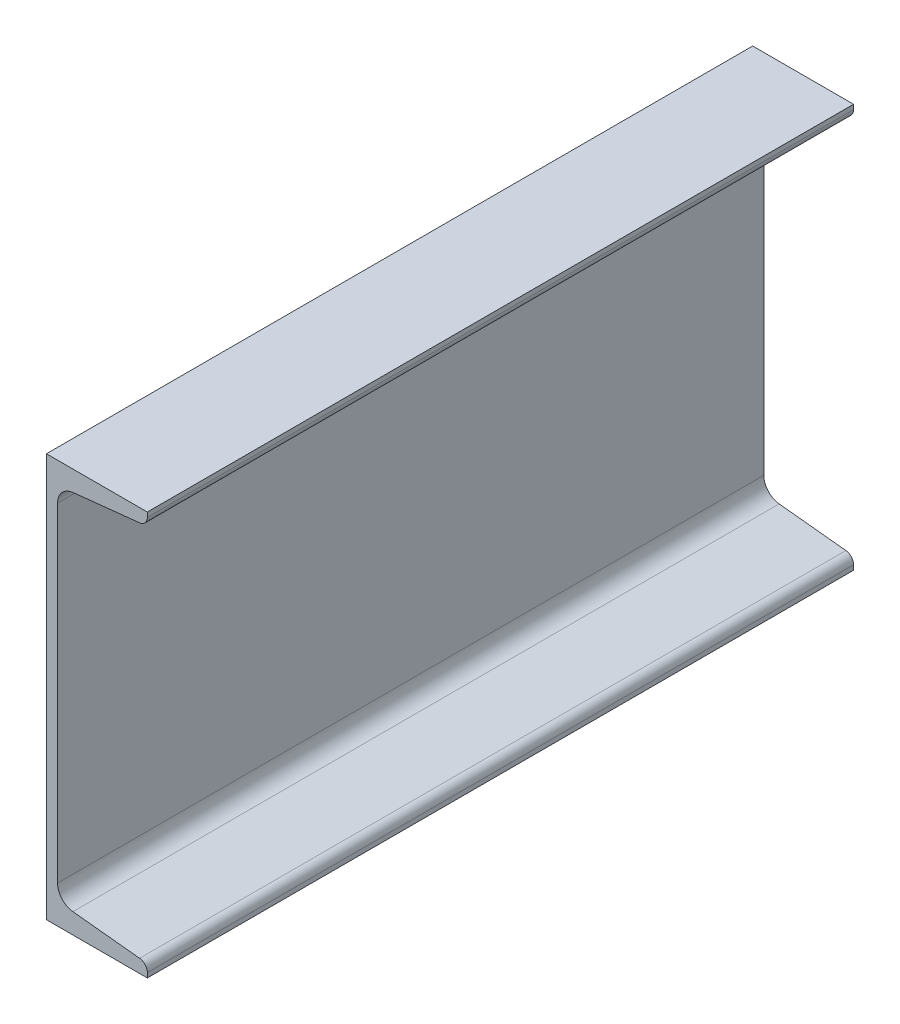
ISO-10303-21;
HEADER;
FILE_DESCRIPTION(('STEP AP214'),'2;1');
FILE_NAME('part.step','',(''),(''),'','','');
FILE_SCHEMA(('AUTOMOTIVE_DESIGN { 1 0 10303 214 1 1 1 1 }'));
ENDSEC;
DATA;
#1=APPLICATION_CONTEXT('core data for automotive mechanical design processes');
#2=APPLICATION_PROTOCOL_DEFINITION('international standard','automotive_design',2000,#1);
#3=PRODUCT_CONTEXT('',#1,'mechanical');
#4=PRODUCT('Part','Part','',(#3));
#5=PRODUCT_RELATED_PRODUCT_CATEGORY('part','',(#4));
#6=PRODUCT_DEFINITION_FORMATION('','',#4);
#7=PRODUCT_DEFINITION_CONTEXT('part definition',#1,'design');
#8=PRODUCT_DEFINITION('design','',#6,#7);
#9=PRODUCT_DEFINITION_SHAPE('','',#8);
#10=(LENGTH_UNIT() NAMED_UNIT(*) SI_UNIT(.MILLI.,.METRE.));
#11=(NAMED_UNIT(*) PLANE_ANGLE_UNIT() SI_UNIT($,.RADIAN.));
#12=(NAMED_UNIT(*) SI_UNIT($,.STERADIAN.) SOLID_ANGLE_UNIT());
#13=UNCERTAINTY_MEASURE_WITH_UNIT(LENGTH_MEASURE(1.E-05),#10,'distance_accuracy_value','');
#14=(GEOMETRIC_REPRESENTATION_CONTEXT(3) GLOBAL_UNCERTAINTY_ASSIGNED_CONTEXT((#13)) GLOBAL_UNIT_ASSIGNED_CONTEXT((#10,
#11,#12)) REPRESENTATION_CONTEXT('',''));
#15=CARTESIAN_POINT('',(0.,0.,0.));
#16=DIRECTION('',(0.,0.,1.));
#17=DIRECTION('',(1.,0.,0.));
#18=AXIS2_PLACEMENT_3D('',#15,#16,#17);
#19=CARTESIAN_POINT('',(1.24287918597476E-13,400.,350.));
#20=DIRECTION('',(1.,0.,0.));
#21=DIRECTION('',(0.,1.,0.));
#22=AXIS2_PLACEMENT_3D('',#19,#20,#21);
#23=PLANE('',#22);
#24=DIRECTION('',(0.,-1.,0.));
#25=VECTOR('',#24,1.);
#26=CARTESIAN_POINT('',(1.24287918597476E-13,400.,-350.));
#27=LINE('',#26,#25);
#28=CARTESIAN_POINT('',(1.24287918597476E-13,400.,-350.));
#29=VERTEX_POINT('',#28);
#30=CARTESIAN_POINT('',(0.,0.,-350.));
#31=VERTEX_POINT('',#30);
#32=EDGE_CURVE('E137',#29,#31,#27,.T.);
#33=ORIENTED_EDGE('',*,*,#32,.T.);
#34=DIRECTION('',(0.,0.,-1.));
#35=VECTOR('',#34,1.);
#36=CARTESIAN_POINT('',(0.,0.,350.));
#37=LINE('',#36,#35);
#38=CARTESIAN_POINT('',(0.,0.,350.));
#39=VERTEX_POINT('',#38);
#40=EDGE_CURVE('E135',#39,#31,#37,.T.);
#41=ORIENTED_EDGE('',*,*,#40,.F.);
#42=DIRECTION('',(0.,-1.,0.));
#43=VECTOR('',#42,1.);
#44=CARTESIAN_POINT('',(1.24287918597476E-13,400.,350.));
#45=LINE('',#44,#43);
#46=CARTESIAN_POINT('',(1.24287918597476E-13,400.,350.));
#47=VERTEX_POINT('',#46);
#48=EDGE_CURVE('E121',#47,#39,#45,.T.);
#49=ORIENTED_EDGE('',*,*,#48,.F.);
#50=DIRECTION('',(0.,0.,-1.));
#51=VECTOR('',#50,1.);
#52=CARTESIAN_POINT('',(1.24287918597476E-13,400.,350.));
#53=LINE('',#52,#51);
#54=EDGE_CURVE('E166',#47,#29,#53,.T.);
#55=ORIENTED_EDGE('',*,*,#54,.T.);
#56=EDGE_LOOP('',(#33,#41,#49,#55));
#57=FACE_BOUND('',#56,.T.);
#58=ADVANCED_FACE('F32',(#57),#23,.F.);
#59=CARTESIAN_POINT('',(100.,0.,350.));
#60=DIRECTION('',(0.,-1.,0.));
#61=DIRECTION('',(0.,0.,-1.));
#62=AXIS2_PLACEMENT_3D('',#59,#60,#61);
#63=PLANE('',#62);
#64=DIRECTION('',(-1.,0.,0.));
#65=VECTOR('',#64,1.);
#66=CARTESIAN_POINT('',(100.,0.,-350.));
#67=LINE('',#66,#65);
#68=CARTESIAN_POINT('',(100.,0.,-350.));
#69=VERTEX_POINT('',#68);
#70=EDGE_CURVE('E168',#69,#31,#67,.T.);
#71=ORIENTED_EDGE('',*,*,#70,.F.);
#72=DIRECTION('',(0.,0.,-1.));
#73=VECTOR('',#72,1.);
#74=CARTESIAN_POINT('',(100.,0.,350.));
#75=LINE('',#74,#73);
#76=CARTESIAN_POINT('',(100.,0.,350.));
#77=VERTEX_POINT('',#76);
#78=EDGE_CURVE('E142',#77,#69,#75,.T.);
#79=ORIENTED_EDGE('',*,*,#78,.F.);
#80=DIRECTION('',(-1.,0.,0.));
#81=VECTOR('',#80,1.);
#82=CARTESIAN_POINT('',(100.,0.,350.));
#83=LINE('',#82,#81);
#84=EDGE_CURVE('E126',#77,#39,#83,.T.);
#85=ORIENTED_EDGE('',*,*,#84,.T.);
#86=ORIENTED_EDGE('',*,*,#40,.T.);
#87=EDGE_LOOP('',(#71,#79,#85,#86));
#88=FACE_BOUND('',#87,.T.);
#89=ADVANCED_FACE('F144',(#88),#63,.T.);
#90=CARTESIAN_POINT('',(100.,0.,350.));
#91=DIRECTION('',(-1.,0.,0.));
#92=DIRECTION('',(0.,0.,1.));
#93=AXIS2_PLACEMENT_3D('',#90,#91,#92);
#94=PLANE('',#93);
#95=DIRECTION('',(0.,1.,0.));
#96=VECTOR('',#95,1.);
#97=CARTESIAN_POINT('',(100.,0.,-350.));
#98=LINE('',#97,#96);
#99=CARTESIAN_POINT('',(100.,4.66942715060438,-350.));
#100=VERTEX_POINT('',#99);
#101=EDGE_CURVE('E170',#69,#100,#98,.T.);
#102=ORIENTED_EDGE('',*,*,#101,.T.);
#103=DIRECTION('',(0.,0.,-1.));
#104=VECTOR('',#103,1.);
#105=CARTESIAN_POINT('',(100.,4.66942715060438,350.));
#106=LINE('',#105,#104);
#107=CARTESIAN_POINT('',(100.,4.66942715060438,350.));
#108=VERTEX_POINT('',#107);
#109=EDGE_CURVE('E209',#100,#108,#106,.F.);
#110=ORIENTED_EDGE('',*,*,#109,.T.);
#111=DIRECTION('',(0.,1.,0.));
#112=VECTOR('',#111,1.);
#113=CARTESIAN_POINT('',(100.,0.,350.));
#114=LINE('',#113,#112);
#115=EDGE_CURVE('E146',#77,#108,#114,.T.);
#116=ORIENTED_EDGE('',*,*,#115,.F.);
#117=ORIENTED_EDGE('',*,*,#78,.T.);
#118=EDGE_LOOP('',(#102,#110,#116,#117));
#119=FACE_BOUND('',#118,.T.);
#120=ADVANCED_FACE('F240',(#119),#94,.F.);
#121=CARTESIAN_POINT('',(26.22301612445,20.0771349975833,350.));
#122=DIRECTION('',(0.104528463267646,0.994521895368274,0.));
#123=DIRECTION('',(-0.994521895368274,0.104528463267646,0.));
#124=AXIS2_PLACEMENT_3D('',#121,#122,#123);
#125=PLANE('',#124);
#126=DIRECTION('',(0.994521895368274,-0.104528463267646,0.));
#127=VECTOR('',#126,1.);
#128=CARTESIAN_POINT('',(26.22301612445,20.0771349975833,350.));
#129=LINE('',#128,#127);
#130=CARTESIAN_POINT('',(26.22301612445,20.0771349975833,350.));
#131=VERTEX_POINT('',#130);
#132=CARTESIAN_POINT('',(92.388491937775,13.1228632612347,350.));
#133=VERTEX_POINT('',#132);
#134=EDGE_CURVE('E148',#131,#133,#129,.T.);
#135=ORIENTED_EDGE('',*,*,#134,.T.);
#136=DIRECTION('',(0.,0.,-1.));
#137=VECTOR('',#136,1.);
#138=CARTESIAN_POINT('',(92.388491937775,13.1228632612347,-350.));
#139=LINE('',#138,#137);
#140=CARTESIAN_POINT('',(92.388491937775,13.1228632612347,-350.));
#141=VERTEX_POINT('',#140);
#142=EDGE_CURVE('E141',#133,#141,#139,.T.);
#143=ORIENTED_EDGE('',*,*,#142,.T.);
#144=DIRECTION('',(0.994521895368274,-0.104528463267646,0.));
#145=VECTOR('',#144,1.);
#146=CARTESIAN_POINT('',(26.22301612445,20.0771349975833,-350.));
#147=LINE('',#146,#145);
#148=CARTESIAN_POINT('',(26.22301612445,20.0771349975833,-350.));
#149=VERTEX_POINT('',#148);
#150=EDGE_CURVE('E173',#149,#141,#147,.T.);
#151=ORIENTED_EDGE('',*,*,#150,.F.);
#152=DIRECTION('',(0.,0.,-1.));
#153=VECTOR('',#152,1.);
#154=CARTESIAN_POINT('',(26.22301612445,20.0771349975833,350.));
#155=LINE('',#154,#153);
#156=EDGE_CURVE('E200',#131,#149,#155,.T.);
#157=ORIENTED_EDGE('',*,*,#156,.F.);
#158=EDGE_LOOP('',(#135,#143,#151,#157));
#159=FACE_BOUND('',#158,.T.);
#160=ADVANCED_FACE('F256',(#159),#125,.T.);
#161=CARTESIAN_POINT('',(28.,36.984007218844,350.));
#162=DIRECTION('',(0.,0.,-1.));
#163=DIRECTION('',(-1.,0.,0.));
#164=AXIS2_PLACEMENT_3D('',#161,#162,#163);
#165=CYLINDRICAL_SURFACE('',#164,17.);
#166=CARTESIAN_POINT('',(28.,36.984007218844,-350.));
#167=DIRECTION('',(0.,0.,1.));
#168=DIRECTION('',(1.,0.,0.));
#169=AXIS2_PLACEMENT_3D('',#166,#167,#168);
#170=CIRCLE('',#169,17.);
#171=CARTESIAN_POINT('',(11.,36.984007218844,-350.));
#172=VERTEX_POINT('',#171);
#173=EDGE_CURVE('E176',#172,#149,#170,.T.);
#174=ORIENTED_EDGE('',*,*,#173,.F.);
#175=DIRECTION('',(0.,0.,-1.));
#176=VECTOR('',#175,1.);
#177=CARTESIAN_POINT('',(11.,36.984007218844,350.));
#178=LINE('',#177,#176);
#179=CARTESIAN_POINT('',(11.,36.984007218844,350.));
#180=VERTEX_POINT('',#179);
#181=EDGE_CURVE('E198',#180,#172,#178,.T.);
#182=ORIENTED_EDGE('',*,*,#181,.F.);
#183=CARTESIAN_POINT('',(28.,36.984007218844,350.));
#184=DIRECTION('',(0.,0.,1.));
#185=DIRECTION('',(1.,0.,0.));
#186=AXIS2_PLACEMENT_3D('',#183,#184,#185);
#187=CIRCLE('',#186,17.);
#188=EDGE_CURVE('E153',#180,#131,#187,.T.);
#189=ORIENTED_EDGE('',*,*,#188,.T.);
#190=ORIENTED_EDGE('',*,*,#156,.T.);
#191=EDGE_LOOP('',(#174,#182,#189,#190));
#192=FACE_BOUND('',#191,.T.);
#193=ADVANCED_FACE('F260',(#192),#165,.F.);
#194=CARTESIAN_POINT('',(11.0000000000001,363.015992781156,350.));
#195=DIRECTION('',(1.,0.,0.));
#196=DIRECTION('',(0.,1.,0.));
#197=AXIS2_PLACEMENT_3D('',#194,#195,#196);
#198=PLANE('',#197);
#199=DIRECTION('',(0.,-1.,0.));
#200=VECTOR('',#199,1.);
#201=CARTESIAN_POINT('',(11.0000000000001,363.015992781156,-350.));
#202=LINE('',#201,#200);
#203=CARTESIAN_POINT('',(11.0000000000001,363.015992781156,-350.));
#204=VERTEX_POINT('',#203);
#205=EDGE_CURVE('E179',#204,#172,#202,.T.);
#206=ORIENTED_EDGE('',*,*,#205,.F.);
#207=DIRECTION('',(0.,0.,-1.));
#208=VECTOR('',#207,1.);
#209=CARTESIAN_POINT('',(11.0000000000001,363.015992781156,350.));
#210=LINE('',#209,#208);
#211=CARTESIAN_POINT('',(11.0000000000001,363.015992781156,350.));
#212=VERTEX_POINT('',#211);
#213=EDGE_CURVE('E196',#212,#204,#210,.T.);
#214=ORIENTED_EDGE('',*,*,#213,.F.);
#215=DIRECTION('',(0.,-1.,0.));
#216=VECTOR('',#215,1.);
#217=CARTESIAN_POINT('',(11.0000000000001,363.015992781156,350.));
#218=LINE('',#217,#216);
#219=EDGE_CURVE('E156',#212,#180,#218,.T.);
#220=ORIENTED_EDGE('',*,*,#219,.T.);
#221=ORIENTED_EDGE('',*,*,#181,.T.);
#222=EDGE_LOOP('',(#206,#214,#220,#221));
#223=FACE_BOUND('',#222,.T.);
#224=ADVANCED_FACE('F264',(#223),#198,.T.);
#225=CARTESIAN_POINT('',(28.0000000000001,363.015992781156,350.));
#226=DIRECTION('',(0.,0.,-1.));
#227=DIRECTION('',(-1.,0.,0.));
#228=AXIS2_PLACEMENT_3D('',#225,#226,#227);
#229=CYLINDRICAL_SURFACE('',#228,17.);
#230=CARTESIAN_POINT('',(28.0000000000001,363.015992781156,-350.));
#231=DIRECTION('',(0.,0.,-1.));
#232=DIRECTION('',(-1.,0.,0.));
#233=AXIS2_PLACEMENT_3D('',#230,#231,#232);
#234=CIRCLE('',#233,17.);
#235=CARTESIAN_POINT('',(26.2230161244501,379.922865002417,-350.));
#236=VERTEX_POINT('',#235);
#237=EDGE_CURVE('E182',#204,#236,#234,.T.);
#238=ORIENTED_EDGE('',*,*,#237,.T.);
#239=DIRECTION('',(0.,0.,-1.));
#240=VECTOR('',#239,1.);
#241=CARTESIAN_POINT('',(26.2230161244501,379.922865002417,350.));
#242=LINE('',#241,#240);
#243=CARTESIAN_POINT('',(26.2230161244501,379.922865002417,350.));
#244=VERTEX_POINT('',#243);
#245=EDGE_CURVE('E193',#244,#236,#242,.T.);
#246=ORIENTED_EDGE('',*,*,#245,.F.);
#247=CARTESIAN_POINT('',(28.0000000000001,363.015992781156,350.));
#248=DIRECTION('',(0.,0.,-1.));
#249=DIRECTION('',(-1.,0.,0.));
#250=AXIS2_PLACEMENT_3D('',#247,#248,#249);
#251=CIRCLE('',#250,17.);
#252=EDGE_CURVE('E159',#212,#244,#251,.T.);
#253=ORIENTED_EDGE('',*,*,#252,.F.);
#254=ORIENTED_EDGE('',*,*,#213,.T.);
#255=EDGE_LOOP('',(#238,#246,#253,#254));
#256=FACE_BOUND('',#255,.T.);
#257=ADVANCED_FACE('F269',(#256),#229,.F.);
#258=CARTESIAN_POINT('',(26.2230161244501,379.922865002417,350.));
#259=DIRECTION('',(-0.104528463267647,0.994521895368274,0.));
#260=DIRECTION('',(-0.994521895368274,-0.104528463267647,0.));
#261=AXIS2_PLACEMENT_3D('',#258,#259,#260);
#262=PLANE('',#261);
#263=DIRECTION('',(0.994521895368274,0.104528463267647,0.));
#264=VECTOR('',#263,1.);
#265=CARTESIAN_POINT('',(26.2230161244501,379.922865002417,-350.));
#266=LINE('',#265,#264);
#267=CARTESIAN_POINT('',(92.3884919377751,386.877136738765,-350.));
#268=VERTEX_POINT('',#267);
#269=EDGE_CURVE('E184',#236,#268,#266,.T.);
#270=ORIENTED_EDGE('',*,*,#269,.T.);
#271=DIRECTION('',(0.,0.,-1.));
#272=VECTOR('',#271,1.);
#273=CARTESIAN_POINT('',(92.3884919377751,386.877136738765,350.));
#274=LINE('',#273,#272);
#275=CARTESIAN_POINT('',(92.3884919377751,386.877136738765,350.));
#276=VERTEX_POINT('',#275);
#277=EDGE_CURVE('E11',#268,#276,#274,.F.);
#278=ORIENTED_EDGE('',*,*,#277,.T.);
#279=DIRECTION('',(0.994521895368274,0.104528463267647,0.));
#280=VECTOR('',#279,1.);
#281=CARTESIAN_POINT('',(26.2230161244501,379.922865002417,350.));
#282=LINE('',#281,#280);
#283=EDGE_CURVE('E161',#244,#276,#282,.T.);
#284=ORIENTED_EDGE('',*,*,#283,.F.);
#285=ORIENTED_EDGE('',*,*,#245,.T.);
#286=EDGE_LOOP('',(#270,#278,#284,#285));
#287=FACE_BOUND('',#286,.T.);
#288=ADVANCED_FACE('F232',(#287),#262,.F.);
#289=CARTESIAN_POINT('',(100.,400.,350.));
#290=DIRECTION('',(1.,0.,0.));
#291=DIRECTION('',(0.,1.,0.));
#292=AXIS2_PLACEMENT_3D('',#289,#290,#291);
#293=PLANE('',#292);
#294=DIRECTION('',(0.,-1.,0.));
#295=VECTOR('',#294,1.);
#296=CARTESIAN_POINT('',(100.,400.,350.));
#297=LINE('',#296,#295);
#298=CARTESIAN_POINT('',(100.,400.,350.));
#299=VERTEX_POINT('',#298);
#300=CARTESIAN_POINT('',(100.,395.330572849396,350.));
#301=VERTEX_POINT('',#300);
#302=EDGE_CURVE('E163',#299,#301,#297,.T.);
#303=ORIENTED_EDGE('',*,*,#302,.T.);
#304=DIRECTION('',(0.,0.,-1.));
#305=VECTOR('',#304,1.);
#306=CARTESIAN_POINT('',(100.,395.330572849396,-350.));
#307=LINE('',#306,#305);
#308=CARTESIAN_POINT('',(100.,395.330572849396,-350.));
#309=VERTEX_POINT('',#308);
#310=EDGE_CURVE('E40',#301,#309,#307,.T.);
#311=ORIENTED_EDGE('',*,*,#310,.T.);
#312=DIRECTION('',(0.,-1.,0.));
#313=VECTOR('',#312,1.);
#314=CARTESIAN_POINT('',(100.,400.,-350.));
#315=LINE('',#314,#313);
#316=CARTESIAN_POINT('',(100.,400.,-350.));
#317=VERTEX_POINT('',#316);
#318=EDGE_CURVE('E186',#317,#309,#315,.T.);
#319=ORIENTED_EDGE('',*,*,#318,.F.);
#320=DIRECTION('',(0.,0.,-1.));
#321=VECTOR('',#320,1.);
#322=CARTESIAN_POINT('',(100.,400.,350.));
#323=LINE('',#322,#321);
#324=EDGE_CURVE('E191',#299,#317,#323,.T.);
#325=ORIENTED_EDGE('',*,*,#324,.F.);
#326=EDGE_LOOP('',(#303,#311,#319,#325));
#327=FACE_BOUND('',#326,.T.);
#328=ADVANCED_FACE('F217',(#327),#293,.T.);
#329=CARTESIAN_POINT('',(100.,400.,350.));
#330=DIRECTION('',(0.,-1.,0.));
#331=DIRECTION('',(0.,0.,-1.));
#332=AXIS2_PLACEMENT_3D('',#329,#330,#331);
#333=PLANE('',#332);
#334=DIRECTION('',(-1.,0.,0.));
#335=VECTOR('',#334,1.);
#336=CARTESIAN_POINT('',(100.,400.,-350.));
#337=LINE('',#336,#335);
#338=EDGE_CURVE('E132',#317,#29,#337,.T.);
#339=ORIENTED_EDGE('',*,*,#338,.T.);
#340=ORIENTED_EDGE('',*,*,#54,.F.);
#341=DIRECTION('',(-1.,0.,0.));
#342=VECTOR('',#341,1.);
#343=CARTESIAN_POINT('',(100.,400.,350.));
#344=LINE('',#343,#342);
#345=EDGE_CURVE('E128',#299,#47,#344,.T.);
#346=ORIENTED_EDGE('',*,*,#345,.F.);
#347=ORIENTED_EDGE('',*,*,#324,.T.);
#348=EDGE_LOOP('',(#339,#340,#346,#347));
#349=FACE_BOUND('',#348,.T.);
#350=ADVANCED_FACE('F224',(#349),#333,.F.);
#351=CARTESIAN_POINT('',(28.,36.984007218844,350.));
#352=DIRECTION('',(0.,0.,1.));
#353=DIRECTION('',(1.,0.,0.));
#354=AXIS2_PLACEMENT_3D('',#351,#352,#353);
#355=PLANE('',#354);
#356=ORIENTED_EDGE('',*,*,#115,.T.);
#357=CARTESIAN_POINT('',(91.5,4.66942715060438,350.));
#358=DIRECTION('',(0.,0.,1.));
#359=DIRECTION('',(1.,0.,0.));
#360=AXIS2_PLACEMENT_3D('',#357,#358,#359);
#361=CIRCLE('',#360,8.5);
#362=EDGE_CURVE('E212',#108,#133,#361,.T.);
#363=ORIENTED_EDGE('',*,*,#362,.T.);
#364=ORIENTED_EDGE('',*,*,#134,.F.);
#365=ORIENTED_EDGE('',*,*,#188,.F.);
#366=ORIENTED_EDGE('',*,*,#219,.F.);
#367=ORIENTED_EDGE('',*,*,#252,.T.);
#368=ORIENTED_EDGE('',*,*,#283,.T.);
#369=CARTESIAN_POINT('',(91.5000000000001,395.330572849396,350.));
#370=DIRECTION('',(0.,0.,1.));
#371=DIRECTION('',(1.,0.,0.));
#372=AXIS2_PLACEMENT_3D('',#369,#370,#371);
#373=CIRCLE('',#372,8.5);
#374=EDGE_CURVE('E47',#276,#301,#373,.T.);
#375=ORIENTED_EDGE('',*,*,#374,.T.);
#376=ORIENTED_EDGE('',*,*,#302,.F.);
#377=ORIENTED_EDGE('',*,*,#345,.T.);
#378=ORIENTED_EDGE('',*,*,#48,.T.);
#379=ORIENTED_EDGE('',*,*,#84,.F.);
#380=EDGE_LOOP('',(#356,#363,#364,#365,#366,#367,#368,#375,#376,#377,#378,#379));
#381=FACE_BOUND('',#380,.T.);
#382=ADVANCED_FACE('F124',(#381),#355,.T.);
#383=CARTESIAN_POINT('',(28.,36.984007218844,-350.));
#384=DIRECTION('',(0.,0.,1.));
#385=DIRECTION('',(1.,0.,0.));
#386=AXIS2_PLACEMENT_3D('',#383,#384,#385);
#387=PLANE('',#386);
#388=ORIENTED_EDGE('',*,*,#150,.T.);
#389=CARTESIAN_POINT('',(91.5,4.66942715060438,-350.));
#390=DIRECTION('',(0.,0.,1.));
#391=DIRECTION('',(1.,0.,0.));
#392=AXIS2_PLACEMENT_3D('',#389,#390,#391);
#393=CIRCLE('',#392,8.5);
#394=EDGE_CURVE('E207',#141,#100,#393,.F.);
#395=ORIENTED_EDGE('',*,*,#394,.T.);
#396=ORIENTED_EDGE('',*,*,#101,.F.);
#397=ORIENTED_EDGE('',*,*,#70,.T.);
#398=ORIENTED_EDGE('',*,*,#32,.F.);
#399=ORIENTED_EDGE('',*,*,#338,.F.);
#400=ORIENTED_EDGE('',*,*,#318,.T.);
#401=CARTESIAN_POINT('',(91.5000000000001,395.330572849396,-350.));
#402=DIRECTION('',(0.,0.,1.));
#403=DIRECTION('',(1.,0.,0.));
#404=AXIS2_PLACEMENT_3D('',#401,#402,#403);
#405=CIRCLE('',#404,8.5);
#406=EDGE_CURVE('E205',#309,#268,#405,.F.);
#407=ORIENTED_EDGE('',*,*,#406,.T.);
#408=ORIENTED_EDGE('',*,*,#269,.F.);
#409=ORIENTED_EDGE('',*,*,#237,.F.);
#410=ORIENTED_EDGE('',*,*,#205,.T.);
#411=ORIENTED_EDGE('',*,*,#173,.T.);
#412=EDGE_LOOP('',(#388,#395,#396,#397,#398,#399,#400,#407,#408,#409,#410,#411));
#413=FACE_BOUND('',#412,.T.);
#414=ADVANCED_FACE('F221',(#413),#387,.F.);
#415=CARTESIAN_POINT('',(91.5,4.66942715060438,350.));
#416=DIRECTION('',(0.,0.,1.));
#417=DIRECTION('',(1.,0.,0.));
#418=AXIS2_PLACEMENT_3D('',#415,#416,#417);
#419=CYLINDRICAL_SURFACE('',#418,8.5);
#420=ORIENTED_EDGE('',*,*,#362,.F.);
#421=ORIENTED_EDGE('',*,*,#109,.F.);
#422=ORIENTED_EDGE('',*,*,#394,.F.);
#423=ORIENTED_EDGE('',*,*,#142,.F.);
#424=EDGE_LOOP('',(#420,#421,#422,#423));
#425=FACE_BOUND('',#424,.T.);
#426=ADVANCED_FACE('F243',(#425),#419,.T.);
#427=CARTESIAN_POINT('',(91.5000000000001,395.330572849396,350.));
#428=DIRECTION('',(0.,0.,1.));
#429=DIRECTION('',(1.,0.,0.));
#430=AXIS2_PLACEMENT_3D('',#427,#428,#429);
#431=CYLINDRICAL_SURFACE('',#430,8.5);
#432=ORIENTED_EDGE('',*,*,#374,.F.);
#433=ORIENTED_EDGE('',*,*,#277,.F.);
#434=ORIENTED_EDGE('',*,*,#406,.F.);
#435=ORIENTED_EDGE('',*,*,#310,.F.);
#436=EDGE_LOOP('',(#432,#433,#434,#435));
#437=FACE_BOUND('',#436,.T.);
#438=ADVANCED_FACE('F34',(#437),#431,.T.);
#439=CLOSED_SHELL('',(#58,#89,#120,#160,#193,#224,#257,#288,#328,#350,#382,#414,#426,#438));
#440=MANIFOLD_SOLID_BREP('B2',#439);
#441=ADVANCED_BREP_SHAPE_REPRESENTATION('',(#18,#440),#14);
#442=SHAPE_DEFINITION_REPRESENTATION(#9,#441);
ENDSEC;
END-ISO-10303-21;
